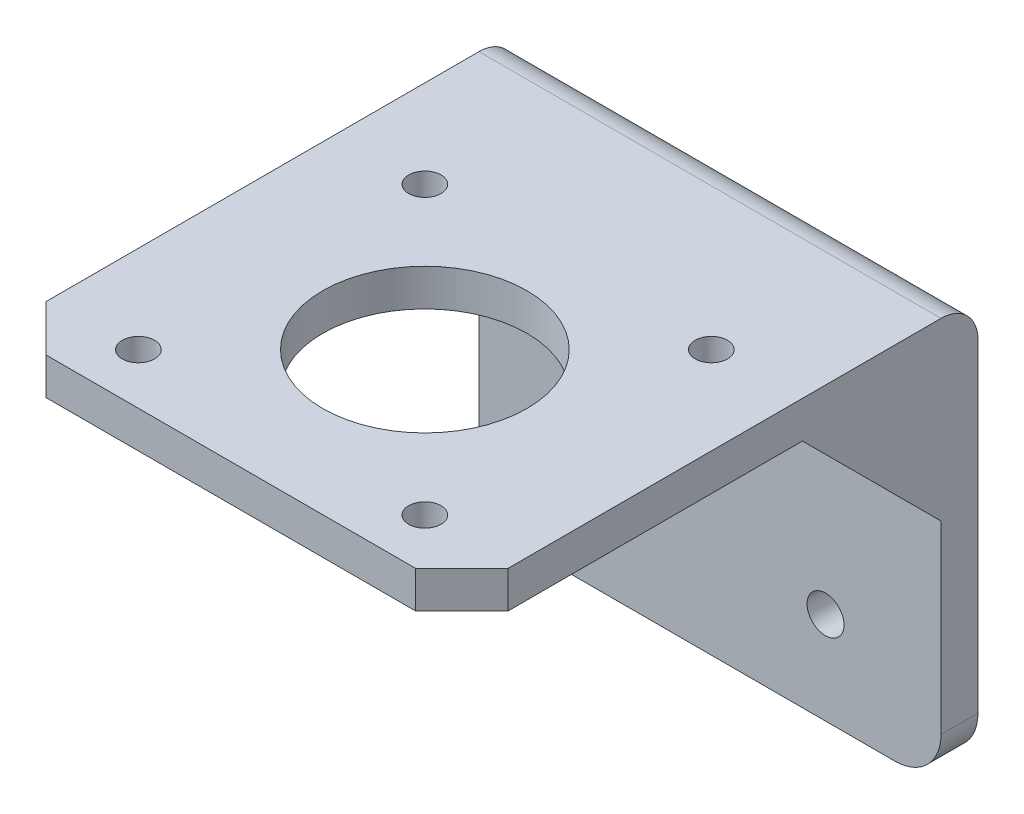
ISO-10303-21;
HEADER;
FILE_DESCRIPTION(('STEP AP214'),'2;1');
FILE_NAME('part.step','',(''),(''),'','','');
FILE_SCHEMA(('AUTOMOTIVE_DESIGN { 1 0 10303 214 1 1 1 1 }'));
ENDSEC;
DATA;
#1=APPLICATION_CONTEXT('core data for automotive mechanical design processes');
#2=APPLICATION_PROTOCOL_DEFINITION('international standard','automotive_design',2000,#1);
#3=PRODUCT_CONTEXT('',#1,'mechanical');
#4=PRODUCT('Part','Part','',(#3));
#5=PRODUCT_RELATED_PRODUCT_CATEGORY('part','',(#4));
#6=PRODUCT_DEFINITION_FORMATION('','',#4);
#7=PRODUCT_DEFINITION_CONTEXT('part definition',#1,'design');
#8=PRODUCT_DEFINITION('design','',#6,#7);
#9=PRODUCT_DEFINITION_SHAPE('','',#8);
#10=(LENGTH_UNIT() NAMED_UNIT(*) SI_UNIT(.MILLI.,.METRE.));
#11=(NAMED_UNIT(*) PLANE_ANGLE_UNIT() SI_UNIT($,.RADIAN.));
#12=(NAMED_UNIT(*) SI_UNIT($,.STERADIAN.) SOLID_ANGLE_UNIT());
#13=UNCERTAINTY_MEASURE_WITH_UNIT(LENGTH_MEASURE(1.E-05),#10,'distance_accuracy_value','');
#14=(GEOMETRIC_REPRESENTATION_CONTEXT(3) GLOBAL_UNCERTAINTY_ASSIGNED_CONTEXT((#13)) GLOBAL_UNIT_ASSIGNED_CONTEXT((#10,
#11,#12)) REPRESENTATION_CONTEXT('',''));
#15=CARTESIAN_POINT('',(0.,0.,0.));
#16=DIRECTION('',(0.,0.,1.));
#17=DIRECTION('',(1.,0.,0.));
#18=AXIS2_PLACEMENT_3D('',#15,#16,#17);
#19=CARTESIAN_POINT('',(20.,-7.49999999999984,-38.1373006168578));
#20=DIRECTION('',(0.,1.,0.));
#21=DIRECTION('',(-1.,0.,0.));
#22=AXIS2_PLACEMENT_3D('',#19,#20,#21);
#23=PLANE('',#22);
#24=CARTESIAN_POINT('',(0.,-7.50000000000008,30.8626993831422));
#25=DIRECTION('',(0.,-1.,0.));
#26=DIRECTION('',(1.,0.,0.));
#27=AXIS2_PLACEMENT_3D('',#24,#25,#26);
#28=CIRCLE('',#27,11.05);
#29=CARTESIAN_POINT('',(11.05,-7.50000000000008,30.8626993831422));
#30=VERTEX_POINT('',#29);
#31=EDGE_CURVE('E263',#30,#30,#28,.T.);
#32=ORIENTED_EDGE('',*,*,#31,.F.);
#33=EDGE_LOOP('',(#32));
#34=FACE_BOUND('',#33,.T.);
#35=CARTESIAN_POINT('',(-15.5,-7.50000000000002,15.3626993831422));
#36=DIRECTION('',(0.,-1.,0.));
#37=DIRECTION('',(1.,0.,0.));
#38=AXIS2_PLACEMENT_3D('',#35,#36,#37);
#39=CIRCLE('',#38,1.75);
#40=CARTESIAN_POINT('',(-13.75,-7.50000000000002,15.3626993831422));
#41=VERTEX_POINT('',#40);
#42=EDGE_CURVE('E318',#41,#41,#39,.T.);
#43=ORIENTED_EDGE('',*,*,#42,.F.);
#44=EDGE_LOOP('',(#43));
#45=FACE_BOUND('',#44,.T.);
#46=CARTESIAN_POINT('',(15.5,-7.50000000000002,15.3626993831422));
#47=DIRECTION('',(0.,-1.,0.));
#48=DIRECTION('',(1.,0.,0.));
#49=AXIS2_PLACEMENT_3D('',#46,#47,#48);
#50=CIRCLE('',#49,1.75);
#51=CARTESIAN_POINT('',(17.25,-7.50000000000002,15.3626993831422));
#52=VERTEX_POINT('',#51);
#53=EDGE_CURVE('E324',#52,#52,#50,.T.);
#54=ORIENTED_EDGE('',*,*,#53,.F.);
#55=EDGE_LOOP('',(#54));
#56=FACE_BOUND('',#55,.T.);
#57=CARTESIAN_POINT('',(-15.5,-7.50000000000013,46.3626993831422));
#58=DIRECTION('',(0.,-1.,0.));
#59=DIRECTION('',(1.,0.,0.));
#60=AXIS2_PLACEMENT_3D('',#57,#58,#59);
#61=CIRCLE('',#60,1.75);
#62=CARTESIAN_POINT('',(-13.75,-7.50000000000013,46.3626993831422));
#63=VERTEX_POINT('',#62);
#64=EDGE_CURVE('E215',#63,#63,#61,.T.);
#65=ORIENTED_EDGE('',*,*,#64,.F.);
#66=EDGE_LOOP('',(#65));
#67=FACE_BOUND('',#66,.T.);
#68=CARTESIAN_POINT('',(15.5,-7.50000000000013,46.3626993831422));
#69=DIRECTION('',(0.,-1.,0.));
#70=DIRECTION('',(1.,0.,0.));
#71=AXIS2_PLACEMENT_3D('',#68,#69,#70);
#72=CIRCLE('',#71,1.75);
#73=CARTESIAN_POINT('',(17.25,-7.50000000000013,46.3626993831422));
#74=VERTEX_POINT('',#73);
#75=EDGE_CURVE('E207',#74,#74,#72,.T.);
#76=ORIENTED_EDGE('',*,*,#75,.F.);
#77=EDGE_LOOP('',(#76));
#78=FACE_BOUND('',#77,.T.);
#79=DIRECTION('',(1.,0.,0.));
#80=VECTOR('',#79,1.);
#81=CARTESIAN_POINT('',(23.,-7.50000000000013,15.));
#82=LINE('',#81,#80);
#83=CARTESIAN_POINT('',(23.,-7.50000000000013,15.));
#84=VERTEX_POINT('',#83);
#85=CARTESIAN_POINT('',(25.,-7.50000000000013,15.));
#86=VERTEX_POINT('',#85);
#87=EDGE_CURVE('E634',#84,#86,#82,.T.);
#88=ORIENTED_EDGE('',*,*,#87,.T.);
#89=DIRECTION('',(0.,0.,1.));
#90=VECTOR('',#89,1.);
#91=CARTESIAN_POINT('',(25.,-7.49999999999984,-38.1373006168578));
#92=LINE('',#91,#90);
#93=CARTESIAN_POINT('',(25.,-7.50000000000013,46.8626993831422));
#94=VERTEX_POINT('',#93);
#95=EDGE_CURVE('E199',#86,#94,#92,.T.);
#96=ORIENTED_EDGE('',*,*,#95,.T.);
#97=DIRECTION('',(-0.707106781186549,0.,0.707106781186546));
#98=VECTOR('',#97,1.);
#99=CARTESIAN_POINT('',(20.,-7.50000000000015,51.8626993831422));
#100=LINE('',#99,#98);
#101=CARTESIAN_POINT('',(20.,-7.50000000000015,51.8626993831422));
#102=VERTEX_POINT('',#101);
#103=EDGE_CURVE('E200',#94,#102,#100,.T.);
#104=ORIENTED_EDGE('',*,*,#103,.T.);
#105=DIRECTION('',(-1.,0.,0.));
#106=VECTOR('',#105,1.);
#107=CARTESIAN_POINT('',(-20.,-7.50000000000015,51.8626993831422));
#108=LINE('',#107,#106);
#109=CARTESIAN_POINT('',(-20.,-7.50000000000015,51.8626993831422));
#110=VERTEX_POINT('',#109);
#111=EDGE_CURVE('E230',#102,#110,#108,.T.);
#112=ORIENTED_EDGE('',*,*,#111,.T.);
#113=DIRECTION('',(-0.707106781186547,0.,-0.707106781186548));
#114=VECTOR('',#113,1.);
#115=CARTESIAN_POINT('',(-25.,-7.50000000000013,46.8626993831422));
#116=LINE('',#115,#114);
#117=CARTESIAN_POINT('',(-25.,-7.50000000000013,46.8626993831422));
#118=VERTEX_POINT('',#117);
#119=EDGE_CURVE('E198',#110,#118,#116,.T.);
#120=ORIENTED_EDGE('',*,*,#119,.T.);
#121=DIRECTION('',(0.,0.,-1.));
#122=VECTOR('',#121,1.);
#123=CARTESIAN_POINT('',(-25.,-7.49999999999984,-38.1373006168578));
#124=LINE('',#123,#122);
#125=CARTESIAN_POINT('',(-25.,-7.50000000000013,15.));
#126=VERTEX_POINT('',#125);
#127=EDGE_CURVE('E201',#118,#126,#124,.T.);
#128=ORIENTED_EDGE('',*,*,#127,.T.);
#129=DIRECTION('',(-1.,0.,0.));
#130=VECTOR('',#129,1.);
#131=CARTESIAN_POINT('',(-23.,-7.50000000000013,15.));
#132=LINE('',#131,#130);
#133=CARTESIAN_POINT('',(-23.,-7.50000000000013,15.));
#134=VERTEX_POINT('',#133);
#135=EDGE_CURVE('E256',#134,#126,#132,.T.);
#136=ORIENTED_EDGE('',*,*,#135,.F.);
#137=DIRECTION('',(0.,0.,-1.));
#138=VECTOR('',#137,1.);
#139=CARTESIAN_POINT('',(-23.,-7.49999999999997,0.00999999999998517));
#140=LINE('',#139,#138);
#141=CARTESIAN_POINT('',(-23.,-7.49999999999997,0.00999999999998517));
#142=VERTEX_POINT('',#141);
#143=EDGE_CURVE('E190',#134,#142,#140,.T.);
#144=ORIENTED_EDGE('',*,*,#143,.T.);
#145=DIRECTION('',(1.,0.,0.));
#146=VECTOR('',#145,1.);
#147=CARTESIAN_POINT('',(20.,-7.49999999999997,0.00999999999997097));
#148=LINE('',#147,#146);
#149=CARTESIAN_POINT('',(23.,-7.49999999999997,0.00999999999998517));
#150=VERTEX_POINT('',#149);
#151=EDGE_CURVE('E50',#142,#150,#148,.T.);
#152=ORIENTED_EDGE('',*,*,#151,.T.);
#153=DIRECTION('',(0.,0.,-1.));
#154=VECTOR('',#153,1.);
#155=CARTESIAN_POINT('',(23.,-7.49999999999997,0.00999999999998517));
#156=LINE('',#155,#154);
#157=EDGE_CURVE('E166',#84,#150,#156,.T.);
#158=ORIENTED_EDGE('',*,*,#157,.F.);
#159=EDGE_LOOP('',(#88,#96,#104,#112,#120,#128,#136,#144,#152,#158));
#160=FACE_BOUND('',#159,.T.);
#161=ADVANCED_FACE('F41',(#34,#45,#56,#67,#78,#160),#23,.F.);
#162=CARTESIAN_POINT('',(20.,-42.5,0.));
#163=DIRECTION('',(0.,0.,-1.));
#164=DIRECTION('',(-1.,0.,0.));
#165=AXIS2_PLACEMENT_3D('',#162,#163,#164);
#166=PLANE('',#165);
#167=CARTESIAN_POINT('',(-12.5,-37.5,0.));
#168=DIRECTION('',(0.,0.,1.));
#169=DIRECTION('',(1.,0.,0.));
#170=AXIS2_PLACEMENT_3D('',#167,#168,#169);
#171=CIRCLE('',#170,2.);
#172=CARTESIAN_POINT('',(-10.5,-37.5,0.));
#173=VERTEX_POINT('',#172);
#174=EDGE_CURVE('E295',#173,#173,#171,.T.);
#175=ORIENTED_EDGE('',*,*,#174,.F.);
#176=EDGE_LOOP('',(#175));
#177=FACE_BOUND('',#176,.T.);
#178=CARTESIAN_POINT('',(12.5,-37.5,0.));
#179=DIRECTION('',(0.,0.,1.));
#180=DIRECTION('',(1.,0.,0.));
#181=AXIS2_PLACEMENT_3D('',#178,#179,#180);
#182=CIRCLE('',#181,2.);
#183=CARTESIAN_POINT('',(14.5,-37.5,0.));
#184=VERTEX_POINT('',#183);
#185=EDGE_CURVE('E298',#184,#184,#182,.T.);
#186=ORIENTED_EDGE('',*,*,#185,.F.);
#187=EDGE_LOOP('',(#186));
#188=FACE_BOUND('',#187,.T.);
#189=DIRECTION('',(1.,0.,0.));
#190=VECTOR('',#189,1.);
#191=CARTESIAN_POINT('',(23.,-22.5000000000003,0.));
#192=LINE('',#191,#190);
#193=CARTESIAN_POINT('',(23.,-22.5000000000003,0.));
#194=VERTEX_POINT('',#193);
#195=CARTESIAN_POINT('',(25.,-22.5000000000003,0.));
#196=VERTEX_POINT('',#195);
#197=EDGE_CURVE('E636',#194,#196,#192,.T.);
#198=ORIENTED_EDGE('',*,*,#197,.F.);
#199=DIRECTION('',(0.,-1.,0.));
#200=VECTOR('',#199,1.);
#201=CARTESIAN_POINT('',(23.,-22.5000000000003,0.));
#202=LINE('',#201,#200);
#203=CARTESIAN_POINT('',(23.,-7.50999999999997,0.));
#204=VERTEX_POINT('',#203);
#205=EDGE_CURVE('E640',#204,#194,#202,.T.);
#206=ORIENTED_EDGE('',*,*,#205,.F.);
#207=DIRECTION('',(1.,0.,0.));
#208=VECTOR('',#207,1.);
#209=CARTESIAN_POINT('',(20.,-7.51,0.));
#210=LINE('',#209,#208);
#211=CARTESIAN_POINT('',(-23.,-7.50999999999997,0.));
#212=VERTEX_POINT('',#211);
#213=EDGE_CURVE('E184',#212,#204,#210,.T.);
#214=ORIENTED_EDGE('',*,*,#213,.F.);
#215=DIRECTION('',(0.,-1.,0.));
#216=VECTOR('',#215,1.);
#217=CARTESIAN_POINT('',(-23.,-22.5000000000003,0.));
#218=LINE('',#217,#216);
#219=CARTESIAN_POINT('',(-23.,-22.5000000000003,0.));
#220=VERTEX_POINT('',#219);
#221=EDGE_CURVE('E654',#212,#220,#218,.T.);
#222=ORIENTED_EDGE('',*,*,#221,.T.);
#223=DIRECTION('',(-1.,0.,0.));
#224=VECTOR('',#223,1.);
#225=CARTESIAN_POINT('',(-23.,-22.5000000000003,0.));
#226=LINE('',#225,#224);
#227=CARTESIAN_POINT('',(-25.,-22.5000000000003,0.));
#228=VERTEX_POINT('',#227);
#229=EDGE_CURVE('E660',#220,#228,#226,.T.);
#230=ORIENTED_EDGE('',*,*,#229,.T.);
#231=DIRECTION('',(0.,-1.,0.));
#232=VECTOR('',#231,1.);
#233=CARTESIAN_POINT('',(-25.,-42.5,0.));
#234=LINE('',#233,#232);
#235=CARTESIAN_POINT('',(-25.,-42.5,0.));
#236=VERTEX_POINT('',#235);
#237=EDGE_CURVE('E281',#228,#236,#234,.T.);
#238=ORIENTED_EDGE('',*,*,#237,.T.);
#239=CARTESIAN_POINT('',(-20.,-42.5,0.));
#240=DIRECTION('',(0.,0.,1.));
#241=DIRECTION('',(1.,0.,0.));
#242=AXIS2_PLACEMENT_3D('',#239,#240,#241);
#243=CIRCLE('',#242,5.);
#244=CARTESIAN_POINT('',(-20.,-47.5,0.));
#245=VERTEX_POINT('',#244);
#246=EDGE_CURVE('E278',#236,#245,#243,.T.);
#247=ORIENTED_EDGE('',*,*,#246,.T.);
#248=DIRECTION('',(1.,0.,0.));
#249=VECTOR('',#248,1.);
#250=CARTESIAN_POINT('',(-20.,-47.5,0.));
#251=LINE('',#250,#249);
#252=CARTESIAN_POINT('',(20.,-47.5,0.));
#253=VERTEX_POINT('',#252);
#254=EDGE_CURVE('E275',#245,#253,#251,.T.);
#255=ORIENTED_EDGE('',*,*,#254,.T.);
#256=CARTESIAN_POINT('',(20.,-42.5,0.));
#257=DIRECTION('',(0.,0.,1.));
#258=DIRECTION('',(-1.,0.,0.));
#259=AXIS2_PLACEMENT_3D('',#256,#257,#258);
#260=CIRCLE('',#259,5.);
#261=CARTESIAN_POINT('',(25.,-42.5,0.));
#262=VERTEX_POINT('',#261);
#263=EDGE_CURVE('E272',#253,#262,#260,.T.);
#264=ORIENTED_EDGE('',*,*,#263,.T.);
#265=DIRECTION('',(0.,1.,0.));
#266=VECTOR('',#265,1.);
#267=CARTESIAN_POINT('',(25.,-42.5,0.));
#268=LINE('',#267,#266);
#269=EDGE_CURVE('E269',#262,#196,#268,.T.);
#270=ORIENTED_EDGE('',*,*,#269,.T.);
#271=EDGE_LOOP('',(#198,#206,#214,#222,#230,#238,#247,#255,#264,#270));
#272=FACE_BOUND('',#271,.T.);
#273=ADVANCED_FACE('F341',(#177,#188,#272),#166,.F.);
#274=CARTESIAN_POINT('',(-25.,-3.49999999999984,-38.1373006168577));
#275=DIRECTION('',(-1.,0.,0.));
#276=DIRECTION('',(0.,0.,-1.));
#277=AXIS2_PLACEMENT_3D('',#274,#275,#276);
#278=PLANE('',#277);
#279=DIRECTION('',(0.,-1.,0.));
#280=VECTOR('',#279,1.);
#281=CARTESIAN_POINT('',(-25.,-42.5,-4.));
#282=LINE('',#281,#280);
#283=CARTESIAN_POINT('',(-25.,-7.50999999999997,-4.));
#284=VERTEX_POINT('',#283);
#285=CARTESIAN_POINT('',(-25.,-42.5,-4.));
#286=VERTEX_POINT('',#285);
#287=EDGE_CURVE('E264',#284,#286,#282,.T.);
#288=ORIENTED_EDGE('',*,*,#287,.T.);
#289=DIRECTION('',(0.,0.,1.));
#290=VECTOR('',#289,1.);
#291=CARTESIAN_POINT('',(-25.,-42.5,-4.));
#292=LINE('',#291,#290);
#293=EDGE_CURVE('E260',#286,#236,#292,.T.);
#294=ORIENTED_EDGE('',*,*,#293,.T.);
#295=ORIENTED_EDGE('',*,*,#237,.F.);
#296=DIRECTION('',(0.,0.707106781186551,0.707106781186543));
#297=VECTOR('',#296,1.);
#298=CARTESIAN_POINT('',(-25.,-7.50000000000013,15.));
#299=LINE('',#298,#297);
#300=EDGE_CURVE('E650',#228,#126,#299,.T.);
#301=ORIENTED_EDGE('',*,*,#300,.T.);
#302=ORIENTED_EDGE('',*,*,#127,.F.);
#303=DIRECTION('',(0.,-1.,0.));
#304=VECTOR('',#303,1.);
#305=CARTESIAN_POINT('',(-25.,-3.50000000000013,46.8626993831422));
#306=LINE('',#305,#304);
#307=CARTESIAN_POINT('',(-25.,-3.50000000000013,46.8626993831422));
#308=VERTEX_POINT('',#307);
#309=EDGE_CURVE('E234',#308,#118,#306,.T.);
#310=ORIENTED_EDGE('',*,*,#309,.F.);
#311=DIRECTION('',(0.,0.,-1.));
#312=VECTOR('',#311,1.);
#313=CARTESIAN_POINT('',(-25.,-3.49999999999984,-38.1373006168577));
#314=LINE('',#313,#312);
#315=CARTESIAN_POINT('',(-25.,-3.49999999999997,0.0100000000000126));
#316=VERTEX_POINT('',#315);
#317=EDGE_CURVE('E196',#308,#316,#314,.T.);
#318=ORIENTED_EDGE('',*,*,#317,.T.);
#319=CARTESIAN_POINT('',(-25.,-7.50999999999997,0.00999999999999959));
#320=DIRECTION('',(1.,0.,0.));
#321=DIRECTION('',(0.,0.,1.));
#322=AXIS2_PLACEMENT_3D('',#319,#320,#321);
#323=CIRCLE('',#322,4.01);
#324=EDGE_CURVE('E249',#284,#316,#323,.T.);
#325=ORIENTED_EDGE('',*,*,#324,.F.);
#326=EDGE_LOOP('',(#288,#294,#295,#301,#302,#310,#318,#325));
#327=FACE_BOUND('',#326,.T.);
#328=ADVANCED_FACE('F43',(#327),#278,.T.);
#329=CARTESIAN_POINT('',(-25.,-3.50000000000013,46.8626993831422));
#330=DIRECTION('',(-0.707106781186548,0.,0.707106781186547));
#331=DIRECTION('',(-0.707106781186547,0.,-0.707106781186548));
#332=AXIS2_PLACEMENT_3D('',#329,#330,#331);
#333=PLANE('',#332);
#334=ORIENTED_EDGE('',*,*,#119,.F.);
#335=DIRECTION('',(0.,-1.,0.));
#336=VECTOR('',#335,1.);
#337=CARTESIAN_POINT('',(-20.,-3.50000000000015,51.8626993831422));
#338=LINE('',#337,#336);
#339=CARTESIAN_POINT('',(-20.,-3.50000000000015,51.8626993831422));
#340=VERTEX_POINT('',#339);
#341=EDGE_CURVE('E236',#340,#110,#338,.T.);
#342=ORIENTED_EDGE('',*,*,#341,.F.);
#343=DIRECTION('',(-0.707106781186547,0.,-0.707106781186548));
#344=VECTOR('',#343,1.);
#345=CARTESIAN_POINT('',(-25.,-3.50000000000013,46.8626993831422));
#346=LINE('',#345,#344);
#347=EDGE_CURVE('E224',#340,#308,#346,.T.);
#348=ORIENTED_EDGE('',*,*,#347,.T.);
#349=ORIENTED_EDGE('',*,*,#309,.T.);
#350=EDGE_LOOP('',(#334,#342,#348,#349));
#351=FACE_BOUND('',#350,.T.);
#352=ADVANCED_FACE('F360',(#351),#333,.T.);
#353=CARTESIAN_POINT('',(-20.,-3.50000000000015,51.8626993831422));
#354=DIRECTION('',(0.,0.,1.));
#355=DIRECTION('',(0.,-1.,0.));
#356=AXIS2_PLACEMENT_3D('',#353,#354,#355);
#357=PLANE('',#356);
#358=ORIENTED_EDGE('',*,*,#111,.F.);
#359=DIRECTION('',(0.,-1.,0.));
#360=VECTOR('',#359,1.);
#361=CARTESIAN_POINT('',(20.,-3.50000000000015,51.8626993831422));
#362=LINE('',#361,#360);
#363=CARTESIAN_POINT('',(20.,-3.50000000000015,51.8626993831422));
#364=VERTEX_POINT('',#363);
#365=EDGE_CURVE('E238',#364,#102,#362,.T.);
#366=ORIENTED_EDGE('',*,*,#365,.F.);
#367=DIRECTION('',(-1.,0.,0.));
#368=VECTOR('',#367,1.);
#369=CARTESIAN_POINT('',(-20.,-3.50000000000015,51.8626993831422));
#370=LINE('',#369,#368);
#371=EDGE_CURVE('E221',#364,#340,#370,.T.);
#372=ORIENTED_EDGE('',*,*,#371,.T.);
#373=ORIENTED_EDGE('',*,*,#341,.T.);
#374=EDGE_LOOP('',(#358,#366,#372,#373));
#375=FACE_BOUND('',#374,.T.);
#376=ADVANCED_FACE('F363',(#375),#357,.T.);
#377=CARTESIAN_POINT('',(20.,-3.50000000000015,51.8626993831422));
#378=DIRECTION('',(0.707106781186546,0.,0.707106781186549));
#379=DIRECTION('',(-0.707106781186549,0.,0.707106781186546));
#380=AXIS2_PLACEMENT_3D('',#377,#378,#379);
#381=PLANE('',#380);
#382=ORIENTED_EDGE('',*,*,#103,.F.);
#383=DIRECTION('',(0.,-1.,0.));
#384=VECTOR('',#383,1.);
#385=CARTESIAN_POINT('',(25.,-3.50000000000013,46.8626993831422));
#386=LINE('',#385,#384);
#387=CARTESIAN_POINT('',(25.,-3.50000000000013,46.8626993831422));
#388=VERTEX_POINT('',#387);
#389=EDGE_CURVE('E227',#388,#94,#386,.T.);
#390=ORIENTED_EDGE('',*,*,#389,.F.);
#391=DIRECTION('',(-0.707106781186549,0.,0.707106781186546));
#392=VECTOR('',#391,1.);
#393=CARTESIAN_POINT('',(20.,-3.50000000000015,51.8626993831422));
#394=LINE('',#393,#392);
#395=EDGE_CURVE('E218',#388,#364,#394,.T.);
#396=ORIENTED_EDGE('',*,*,#395,.T.);
#397=ORIENTED_EDGE('',*,*,#365,.T.);
#398=EDGE_LOOP('',(#382,#390,#396,#397));
#399=FACE_BOUND('',#398,.T.);
#400=ADVANCED_FACE('F367',(#399),#381,.T.);
#401=CARTESIAN_POINT('',(25.,-3.49999999999984,-38.1373006168577));
#402=DIRECTION('',(1.,0.,0.));
#403=DIRECTION('',(0.,1.,0.));
#404=AXIS2_PLACEMENT_3D('',#401,#402,#403);
#405=PLANE('',#404);
#406=DIRECTION('',(0.,0.,1.));
#407=VECTOR('',#406,1.);
#408=CARTESIAN_POINT('',(25.,-3.49999999999984,-38.1373006168577));
#409=LINE('',#408,#407);
#410=CARTESIAN_POINT('',(25.,-3.49999999999997,0.0100000000000091));
#411=VERTEX_POINT('',#410);
#412=EDGE_CURVE('E45',#411,#388,#409,.T.);
#413=ORIENTED_EDGE('',*,*,#412,.T.);
#414=ORIENTED_EDGE('',*,*,#389,.T.);
#415=ORIENTED_EDGE('',*,*,#95,.F.);
#416=DIRECTION('',(0.,0.707106781186551,0.707106781186543));
#417=VECTOR('',#416,1.);
#418=CARTESIAN_POINT('',(25.,-7.50000000000013,15.));
#419=LINE('',#418,#417);
#420=EDGE_CURVE('E185',#196,#86,#419,.T.);
#421=ORIENTED_EDGE('',*,*,#420,.F.);
#422=ORIENTED_EDGE('',*,*,#269,.F.);
#423=DIRECTION('',(0.,0.,1.));
#424=VECTOR('',#423,1.);
#425=CARTESIAN_POINT('',(25.,-42.5,-4.));
#426=LINE('',#425,#424);
#427=CARTESIAN_POINT('',(25.,-42.5,-4.));
#428=VERTEX_POINT('',#427);
#429=EDGE_CURVE('E301',#428,#262,#426,.T.);
#430=ORIENTED_EDGE('',*,*,#429,.F.);
#431=DIRECTION('',(0.,1.,0.));
#432=VECTOR('',#431,1.);
#433=CARTESIAN_POINT('',(25.,-42.5,-4.));
#434=LINE('',#433,#432);
#435=CARTESIAN_POINT('',(25.,-7.50999999999997,-4.));
#436=VERTEX_POINT('',#435);
#437=EDGE_CURVE('E284',#428,#436,#434,.T.);
#438=ORIENTED_EDGE('',*,*,#437,.T.);
#439=CARTESIAN_POINT('',(25.,-7.50999999999997,0.00999999999999959));
#440=DIRECTION('',(-1.,0.,0.));
#441=DIRECTION('',(0.,0.,-1.));
#442=AXIS2_PLACEMENT_3D('',#439,#440,#441);
#443=CIRCLE('',#442,4.01);
#444=EDGE_CURVE('E247',#411,#436,#443,.T.);
#445=ORIENTED_EDGE('',*,*,#444,.F.);
#446=EDGE_LOOP('',(#413,#414,#415,#421,#422,#430,#438,#445));
#447=FACE_BOUND('',#446,.T.);
#448=ADVANCED_FACE('F251',(#447),#405,.T.);
#449=CARTESIAN_POINT('',(20.,-3.49999999999984,-38.1373006168578));
#450=DIRECTION('',(0.,1.,0.));
#451=DIRECTION('',(-1.,0.,0.));
#452=AXIS2_PLACEMENT_3D('',#449,#450,#451);
#453=PLANE('',#452);
#454=DIRECTION('',(1.,0.,0.));
#455=VECTOR('',#454,1.);
#456=CARTESIAN_POINT('',(20.,-3.49999999999997,0.0100000000000126));
#457=LINE('',#456,#455);
#458=EDGE_CURVE('E62',#316,#411,#457,.T.);
#459=ORIENTED_EDGE('',*,*,#458,.F.);
#460=ORIENTED_EDGE('',*,*,#317,.F.);
#461=ORIENTED_EDGE('',*,*,#347,.F.);
#462=ORIENTED_EDGE('',*,*,#371,.F.);
#463=ORIENTED_EDGE('',*,*,#395,.F.);
#464=ORIENTED_EDGE('',*,*,#412,.F.);
#465=EDGE_LOOP('',(#459,#460,#461,#462,#463,#464));
#466=FACE_BOUND('',#465,.T.);
#467=CARTESIAN_POINT('',(0.,-3.50000000000008,30.8626993831422));
#468=DIRECTION('',(0.,-1.,0.));
#469=DIRECTION('',(1.,0.,0.));
#470=AXIS2_PLACEMENT_3D('',#467,#468,#469);
#471=CIRCLE('',#470,11.05);
#472=CARTESIAN_POINT('',(11.05,-3.50000000000008,30.8626993831422));
#473=VERTEX_POINT('',#472);
#474=EDGE_CURVE('E315',#473,#473,#471,.T.);
#475=ORIENTED_EDGE('',*,*,#474,.T.);
#476=EDGE_LOOP('',(#475));
#477=FACE_BOUND('',#476,.T.);
#478=CARTESIAN_POINT('',(-15.5,-3.50000000000002,15.3626993831423));
#479=DIRECTION('',(0.,-1.,0.));
#480=DIRECTION('',(1.,0.,0.));
#481=AXIS2_PLACEMENT_3D('',#478,#479,#480);
#482=CIRCLE('',#481,1.75);
#483=CARTESIAN_POINT('',(-13.75,-3.50000000000002,15.3626993831423));
#484=VERTEX_POINT('',#483);
#485=EDGE_CURVE('E321',#484,#484,#482,.T.);
#486=ORIENTED_EDGE('',*,*,#485,.T.);
#487=EDGE_LOOP('',(#486));
#488=FACE_BOUND('',#487,.T.);
#489=CARTESIAN_POINT('',(15.5,-3.50000000000002,15.3626993831422));
#490=DIRECTION('',(0.,-1.,0.));
#491=DIRECTION('',(1.,0.,0.));
#492=AXIS2_PLACEMENT_3D('',#489,#490,#491);
#493=CIRCLE('',#492,1.75);
#494=CARTESIAN_POINT('',(17.25,-3.50000000000002,15.3626993831422));
#495=VERTEX_POINT('',#494);
#496=EDGE_CURVE('E327',#495,#495,#493,.T.);
#497=ORIENTED_EDGE('',*,*,#496,.T.);
#498=EDGE_LOOP('',(#497));
#499=FACE_BOUND('',#498,.T.);
#500=CARTESIAN_POINT('',(-15.5,-3.50000000000013,46.3626993831422));
#501=DIRECTION('',(0.,-1.,0.));
#502=DIRECTION('',(1.,0.,0.));
#503=AXIS2_PLACEMENT_3D('',#500,#501,#502);
#504=CIRCLE('',#503,1.75);
#505=CARTESIAN_POINT('',(-13.75,-3.50000000000013,46.3626993831422));
#506=VERTEX_POINT('',#505);
#507=EDGE_CURVE('E212',#506,#506,#504,.T.);
#508=ORIENTED_EDGE('',*,*,#507,.T.);
#509=EDGE_LOOP('',(#508));
#510=FACE_BOUND('',#509,.T.);
#511=CARTESIAN_POINT('',(15.5,-3.50000000000013,46.3626993831422));
#512=DIRECTION('',(0.,-1.,0.));
#513=DIRECTION('',(1.,0.,0.));
#514=AXIS2_PLACEMENT_3D('',#511,#512,#513);
#515=CIRCLE('',#514,1.75);
#516=CARTESIAN_POINT('',(17.25,-3.50000000000013,46.3626993831422));
#517=VERTEX_POINT('',#516);
#518=EDGE_CURVE('E203',#517,#517,#515,.T.);
#519=ORIENTED_EDGE('',*,*,#518,.T.);
#520=EDGE_LOOP('',(#519));
#521=FACE_BOUND('',#520,.T.);
#522=ADVANCED_FACE('F347',(#466,#477,#488,#499,#510,#521),#453,.T.);
#523=CARTESIAN_POINT('',(15.5,-3.50000000000013,46.3626993831422));
#524=DIRECTION('',(0.,-1.,0.));
#525=DIRECTION('',(1.,0.,0.));
#526=AXIS2_PLACEMENT_3D('',#523,#524,#525);
#527=CYLINDRICAL_SURFACE('',#526,1.75);
#528=ORIENTED_EDGE('',*,*,#518,.F.);
#529=EDGE_LOOP('',(#528));
#530=FACE_BOUND('',#529,.T.);
#531=ORIENTED_EDGE('',*,*,#75,.T.);
#532=EDGE_LOOP('',(#531));
#533=FACE_BOUND('',#532,.T.);
#534=ADVANCED_FACE('F345',(#530,#533),#527,.F.);
#535=CARTESIAN_POINT('',(-15.5,-3.50000000000013,46.3626993831422));
#536=DIRECTION('',(0.,-1.,0.));
#537=DIRECTION('',(1.,0.,0.));
#538=AXIS2_PLACEMENT_3D('',#535,#536,#537);
#539=CYLINDRICAL_SURFACE('',#538,1.75);
#540=ORIENTED_EDGE('',*,*,#507,.F.);
#541=EDGE_LOOP('',(#540));
#542=FACE_BOUND('',#541,.T.);
#543=ORIENTED_EDGE('',*,*,#64,.T.);
#544=EDGE_LOOP('',(#543));
#545=FACE_BOUND('',#544,.T.);
#546=ADVANCED_FACE('F337',(#542,#545),#539,.F.);
#547=CARTESIAN_POINT('',(15.5,-3.50000000000002,15.3626993831422));
#548=DIRECTION('',(0.,-1.,0.));
#549=DIRECTION('',(1.,0.,0.));
#550=AXIS2_PLACEMENT_3D('',#547,#548,#549);
#551=CYLINDRICAL_SURFACE('',#550,1.75);
#552=ORIENTED_EDGE('',*,*,#496,.F.);
#553=EDGE_LOOP('',(#552));
#554=FACE_BOUND('',#553,.T.);
#555=ORIENTED_EDGE('',*,*,#53,.T.);
#556=EDGE_LOOP('',(#555));
#557=FACE_BOUND('',#556,.T.);
#558=ADVANCED_FACE('F354',(#554,#557),#551,.F.);
#559=CARTESIAN_POINT('',(-15.5,-3.50000000000002,15.3626993831423));
#560=DIRECTION('',(0.,-1.,0.));
#561=DIRECTION('',(1.,0.,0.));
#562=AXIS2_PLACEMENT_3D('',#559,#560,#561);
#563=CYLINDRICAL_SURFACE('',#562,1.75);
#564=ORIENTED_EDGE('',*,*,#485,.F.);
#565=EDGE_LOOP('',(#564));
#566=FACE_BOUND('',#565,.T.);
#567=ORIENTED_EDGE('',*,*,#42,.T.);
#568=EDGE_LOOP('',(#567));
#569=FACE_BOUND('',#568,.T.);
#570=ADVANCED_FACE('F409',(#566,#569),#563,.F.);
#571=CARTESIAN_POINT('',(0.,-3.50000000000008,30.8626993831422));
#572=DIRECTION('',(0.,-1.,0.));
#573=DIRECTION('',(1.,0.,0.));
#574=AXIS2_PLACEMENT_3D('',#571,#572,#573);
#575=CYLINDRICAL_SURFACE('',#574,11.05);
#576=ORIENTED_EDGE('',*,*,#474,.F.);
#577=EDGE_LOOP('',(#576));
#578=FACE_BOUND('',#577,.T.);
#579=ORIENTED_EDGE('',*,*,#31,.T.);
#580=EDGE_LOOP('',(#579));
#581=FACE_BOUND('',#580,.T.);
#582=ADVANCED_FACE('F419',(#578,#581),#575,.F.);
#583=CARTESIAN_POINT('',(-20.,-42.5,-4.));
#584=DIRECTION('',(0.,0.,1.));
#585=DIRECTION('',(1.,0.,0.));
#586=AXIS2_PLACEMENT_3D('',#583,#584,#585);
#587=CYLINDRICAL_SURFACE('',#586,5.);
#588=ORIENTED_EDGE('',*,*,#246,.F.);
#589=ORIENTED_EDGE('',*,*,#293,.F.);
#590=CARTESIAN_POINT('',(-20.,-42.5,-4.));
#591=DIRECTION('',(0.,0.,1.));
#592=DIRECTION('',(1.,0.,0.));
#593=AXIS2_PLACEMENT_3D('',#590,#591,#592);
#594=CIRCLE('',#593,5.);
#595=CARTESIAN_POINT('',(-20.,-47.5,-4.));
#596=VERTEX_POINT('',#595);
#597=EDGE_CURVE('E254',#286,#596,#594,.T.);
#598=ORIENTED_EDGE('',*,*,#597,.T.);
#599=DIRECTION('',(0.,0.,1.));
#600=VECTOR('',#599,1.);
#601=CARTESIAN_POINT('',(-20.,-47.5,-4.));
#602=LINE('',#601,#600);
#603=EDGE_CURVE('E311',#596,#245,#602,.T.);
#604=ORIENTED_EDGE('',*,*,#603,.T.);
#605=EDGE_LOOP('',(#588,#589,#598,#604));
#606=FACE_BOUND('',#605,.T.);
#607=ADVANCED_FACE('F430',(#606),#587,.T.);
#608=CARTESIAN_POINT('',(-20.,-47.5,-4.));
#609=DIRECTION('',(0.,-1.,0.));
#610=DIRECTION('',(0.,0.,-1.));
#611=AXIS2_PLACEMENT_3D('',#608,#609,#610);
#612=PLANE('',#611);
#613=ORIENTED_EDGE('',*,*,#254,.F.);
#614=ORIENTED_EDGE('',*,*,#603,.F.);
#615=DIRECTION('',(1.,0.,0.));
#616=VECTOR('',#615,1.);
#617=CARTESIAN_POINT('',(-20.,-47.5,-4.));
#618=LINE('',#617,#616);
#619=CARTESIAN_POINT('',(20.,-47.5,-4.));
#620=VERTEX_POINT('',#619);
#621=EDGE_CURVE('E308',#596,#620,#618,.T.);
#622=ORIENTED_EDGE('',*,*,#621,.T.);
#623=DIRECTION('',(0.,0.,1.));
#624=VECTOR('',#623,1.);
#625=CARTESIAN_POINT('',(20.,-47.5,-4.));
#626=LINE('',#625,#624);
#627=EDGE_CURVE('E306',#620,#253,#626,.T.);
#628=ORIENTED_EDGE('',*,*,#627,.T.);
#629=EDGE_LOOP('',(#613,#614,#622,#628));
#630=FACE_BOUND('',#629,.T.);
#631=ADVANCED_FACE('F441',(#630),#612,.T.);
#632=CARTESIAN_POINT('',(20.,-42.5,-4.));
#633=DIRECTION('',(0.,0.,1.));
#634=DIRECTION('',(1.,0.,0.));
#635=AXIS2_PLACEMENT_3D('',#632,#633,#634);
#636=CYLINDRICAL_SURFACE('',#635,5.);
#637=ORIENTED_EDGE('',*,*,#263,.F.);
#638=ORIENTED_EDGE('',*,*,#627,.F.);
#639=CARTESIAN_POINT('',(20.,-42.5,-4.));
#640=DIRECTION('',(0.,0.,1.));
#641=DIRECTION('',(-1.,0.,0.));
#642=AXIS2_PLACEMENT_3D('',#639,#640,#641);
#643=CIRCLE('',#642,5.);
#644=EDGE_CURVE('E303',#620,#428,#643,.T.);
#645=ORIENTED_EDGE('',*,*,#644,.T.);
#646=ORIENTED_EDGE('',*,*,#429,.T.);
#647=EDGE_LOOP('',(#637,#638,#645,#646));
#648=FACE_BOUND('',#647,.T.);
#649=ADVANCED_FACE('F452',(#648),#636,.T.);
#650=CARTESIAN_POINT('',(12.5,-37.5,-4.));
#651=DIRECTION('',(0.,0.,1.));
#652=DIRECTION('',(1.,0.,0.));
#653=AXIS2_PLACEMENT_3D('',#650,#651,#652);
#654=CYLINDRICAL_SURFACE('',#653,2.);
#655=CARTESIAN_POINT('',(12.5,-37.5,-4.));
#656=DIRECTION('',(0.,0.,1.));
#657=DIRECTION('',(1.,0.,0.));
#658=AXIS2_PLACEMENT_3D('',#655,#656,#657);
#659=CIRCLE('',#658,2.);
#660=CARTESIAN_POINT('',(14.5,-37.5,-4.));
#661=VERTEX_POINT('',#660);
#662=EDGE_CURVE('E289',#661,#661,#659,.T.);
#663=ORIENTED_EDGE('',*,*,#662,.F.);
#664=EDGE_LOOP('',(#663));
#665=FACE_BOUND('',#664,.T.);
#666=ORIENTED_EDGE('',*,*,#185,.T.);
#667=EDGE_LOOP('',(#666));
#668=FACE_BOUND('',#667,.T.);
#669=ADVANCED_FACE('F463',(#665,#668),#654,.F.);
#670=CARTESIAN_POINT('',(-12.5,-37.5,-4.));
#671=DIRECTION('',(0.,0.,1.));
#672=DIRECTION('',(1.,0.,0.));
#673=AXIS2_PLACEMENT_3D('',#670,#671,#672);
#674=CYLINDRICAL_SURFACE('',#673,2.);
#675=CARTESIAN_POINT('',(-12.5,-37.5,-4.));
#676=DIRECTION('',(0.,0.,1.));
#677=DIRECTION('',(1.,0.,0.));
#678=AXIS2_PLACEMENT_3D('',#675,#676,#677);
#679=CIRCLE('',#678,2.);
#680=CARTESIAN_POINT('',(-10.5,-37.5,-4.));
#681=VERTEX_POINT('',#680);
#682=EDGE_CURVE('E292',#681,#681,#679,.T.);
#683=ORIENTED_EDGE('',*,*,#682,.F.);
#684=EDGE_LOOP('',(#683));
#685=FACE_BOUND('',#684,.T.);
#686=ORIENTED_EDGE('',*,*,#174,.T.);
#687=EDGE_LOOP('',(#686));
#688=FACE_BOUND('',#687,.T.);
#689=ADVANCED_FACE('F474',(#685,#688),#674,.F.);
#690=CARTESIAN_POINT('',(20.,-42.5,-4.));
#691=DIRECTION('',(0.,0.,-1.));
#692=DIRECTION('',(-1.,0.,0.));
#693=AXIS2_PLACEMENT_3D('',#690,#691,#692);
#694=PLANE('',#693);
#695=ORIENTED_EDGE('',*,*,#682,.T.);
#696=EDGE_LOOP('',(#695));
#697=FACE_BOUND('',#696,.T.);
#698=ORIENTED_EDGE('',*,*,#662,.T.);
#699=EDGE_LOOP('',(#698));
#700=FACE_BOUND('',#699,.T.);
#701=ORIENTED_EDGE('',*,*,#287,.F.);
#702=DIRECTION('',(1.,0.,0.));
#703=VECTOR('',#702,1.);
#704=CARTESIAN_POINT('',(20.,-7.50999999999997,-4.));
#705=LINE('',#704,#703);
#706=EDGE_CURVE('E287',#284,#436,#705,.T.);
#707=ORIENTED_EDGE('',*,*,#706,.T.);
#708=ORIENTED_EDGE('',*,*,#437,.F.);
#709=ORIENTED_EDGE('',*,*,#644,.F.);
#710=ORIENTED_EDGE('',*,*,#621,.F.);
#711=ORIENTED_EDGE('',*,*,#597,.F.);
#712=EDGE_LOOP('',(#701,#707,#708,#709,#710,#711));
#713=FACE_BOUND('',#712,.T.);
#714=ADVANCED_FACE('F485',(#697,#700,#713),#694,.T.);
#715=CARTESIAN_POINT('',(-50.259014586293,-7.50999999999997,0.00999999999999959));
#716=DIRECTION('',(1.,0.,0.));
#717=DIRECTION('',(0.,0.,-1.));
#718=AXIS2_PLACEMENT_3D('',#715,#716,#717);
#719=CYLINDRICAL_SURFACE('',#718,4.01);
#720=ORIENTED_EDGE('',*,*,#444,.T.);
#721=ORIENTED_EDGE('',*,*,#706,.F.);
#722=ORIENTED_EDGE('',*,*,#324,.T.);
#723=ORIENTED_EDGE('',*,*,#458,.T.);
#724=EDGE_LOOP('',(#720,#721,#722,#723));
#725=FACE_BOUND('',#724,.T.);
#726=ADVANCED_FACE('F245',(#725),#719,.T.);
#727=CARTESIAN_POINT('',(-50.259014586293,-7.50999999999997,0.00999999999999959));
#728=DIRECTION('',(1.,0.,0.));
#729=DIRECTION('',(0.,0.,-1.));
#730=AXIS2_PLACEMENT_3D('',#727,#728,#729);
#731=CYLINDRICAL_SURFACE('',#730,0.00999999999999959);
#732=ORIENTED_EDGE('',*,*,#213,.T.);
#733=CARTESIAN_POINT('',(23.,-7.50999999999997,0.0099999999999971));
#734=DIRECTION('',(-1.,0.,0.));
#735=DIRECTION('',(0.,1.,0.));
#736=AXIS2_PLACEMENT_3D('',#733,#734,#735);
#737=CIRCLE('',#736,0.0099999999999969);
#738=EDGE_CURVE('E169',#150,#204,#737,.T.);
#739=ORIENTED_EDGE('',*,*,#738,.F.);
#740=ORIENTED_EDGE('',*,*,#151,.F.);
#741=CARTESIAN_POINT('',(-23.,-7.50999999999997,0.0099999999999971));
#742=DIRECTION('',(-1.,0.,0.));
#743=DIRECTION('',(0.,1.,0.));
#744=AXIS2_PLACEMENT_3D('',#741,#742,#743);
#745=CIRCLE('',#744,0.0099999999999969);
#746=EDGE_CURVE('E652',#142,#212,#745,.T.);
#747=ORIENTED_EDGE('',*,*,#746,.T.);
#748=EDGE_LOOP('',(#732,#739,#740,#747));
#749=FACE_BOUND('',#748,.T.);
#750=ADVANCED_FACE('F181',(#749),#731,.F.);
#751=CARTESIAN_POINT('',(-23.,-7.50000000000013,15.));
#752=DIRECTION('',(0.,-0.707106781186544,0.707106781186552));
#753=DIRECTION('',(0.,-0.707106781186551,-0.707106781186544));
#754=AXIS2_PLACEMENT_3D('',#751,#752,#753);
#755=PLANE('',#754);
#756=ORIENTED_EDGE('',*,*,#300,.F.);
#757=ORIENTED_EDGE('',*,*,#229,.F.);
#758=DIRECTION('',(0.,0.707106781186551,0.707106781186543));
#759=VECTOR('',#758,1.);
#760=CARTESIAN_POINT('',(-23.,-7.50000000000013,15.));
#761=LINE('',#760,#759);
#762=EDGE_CURVE('E663',#220,#134,#761,.T.);
#763=ORIENTED_EDGE('',*,*,#762,.T.);
#764=ORIENTED_EDGE('',*,*,#135,.T.);
#765=EDGE_LOOP('',(#756,#757,#763,#764));
#766=FACE_BOUND('',#765,.T.);
#767=ADVANCED_FACE('F523',(#766),#755,.T.);
#768=CARTESIAN_POINT('',(-23.,-7.50999999999997,0.0099999999999971));
#769=DIRECTION('',(1.,0.,0.));
#770=DIRECTION('',(0.,1.,0.));
#771=AXIS2_PLACEMENT_3D('',#768,#769,#770);
#772=PLANE('',#771);
#773=ORIENTED_EDGE('',*,*,#746,.F.);
#774=ORIENTED_EDGE('',*,*,#143,.F.);
#775=ORIENTED_EDGE('',*,*,#762,.F.);
#776=ORIENTED_EDGE('',*,*,#221,.F.);
#777=EDGE_LOOP('',(#773,#774,#775,#776));
#778=FACE_BOUND('',#777,.T.);
#779=ADVANCED_FACE('F527',(#778),#772,.T.);
#780=CARTESIAN_POINT('',(23.,-7.50000000000013,15.));
#781=DIRECTION('',(0.,0.707106781186544,-0.707106781186552));
#782=DIRECTION('',(0.,0.707106781186551,0.707106781186544));
#783=AXIS2_PLACEMENT_3D('',#780,#781,#782);
#784=PLANE('',#783);
#785=ORIENTED_EDGE('',*,*,#420,.T.);
#786=ORIENTED_EDGE('',*,*,#87,.F.);
#787=DIRECTION('',(0.,0.707106781186551,0.707106781186543));
#788=VECTOR('',#787,1.);
#789=CARTESIAN_POINT('',(23.,-7.50000000000013,15.));
#790=LINE('',#789,#788);
#791=EDGE_CURVE('E172',#194,#84,#790,.T.);
#792=ORIENTED_EDGE('',*,*,#791,.F.);
#793=ORIENTED_EDGE('',*,*,#197,.T.);
#794=EDGE_LOOP('',(#785,#786,#792,#793));
#795=FACE_BOUND('',#794,.T.);
#796=ADVANCED_FACE('F537',(#795),#784,.F.);
#797=CARTESIAN_POINT('',(23.,-7.50999999999997,0.0099999999999971));
#798=DIRECTION('',(-1.,0.,0.));
#799=DIRECTION('',(0.,1.,0.));
#800=AXIS2_PLACEMENT_3D('',#797,#798,#799);
#801=PLANE('',#800);
#802=ORIENTED_EDGE('',*,*,#738,.T.);
#803=ORIENTED_EDGE('',*,*,#205,.T.);
#804=ORIENTED_EDGE('',*,*,#791,.T.);
#805=ORIENTED_EDGE('',*,*,#157,.T.);
#806=EDGE_LOOP('',(#802,#803,#804,#805));
#807=FACE_BOUND('',#806,.T.);
#808=ADVANCED_FACE('F168',(#807),#801,.T.);
#809=CLOSED_SHELL('',(#161,#273,#328,#352,#376,#400,#448,#522,#534,#546,#558,#570,#582,#607,
#631,#649,#669,#689,#714,#726,#750,#767,#779,#796,#808));
#810=MANIFOLD_SOLID_BREP('B2',#809);
#811=ADVANCED_BREP_SHAPE_REPRESENTATION('',(#18,#810),#14);
#812=SHAPE_DEFINITION_REPRESENTATION(#9,#811);
ENDSEC;
END-ISO-10303-21;
